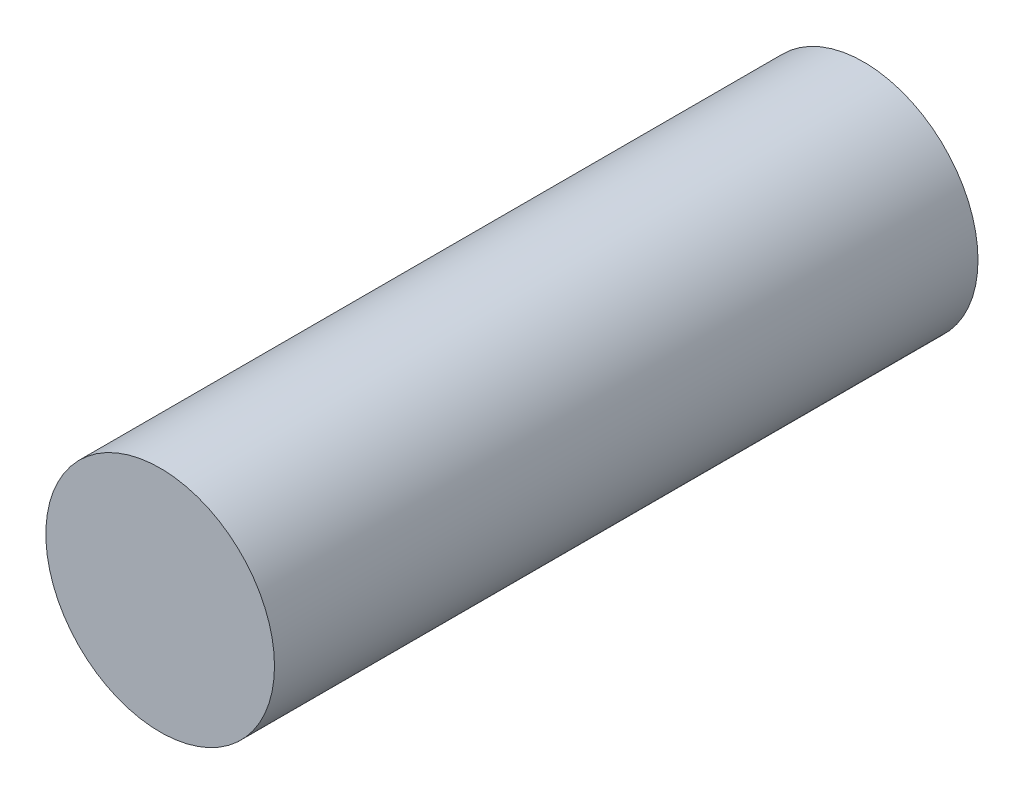
ISO-10303-21;
HEADER;
FILE_DESCRIPTION(('STEP AP214'),'2;1');
FILE_NAME('part.step','',(''),(''),'','','');
FILE_SCHEMA(('AUTOMOTIVE_DESIGN { 1 0 10303 214 1 1 1 1 }'));
ENDSEC;
DATA;
#1=APPLICATION_CONTEXT('core data for automotive mechanical design processes');
#2=APPLICATION_PROTOCOL_DEFINITION('international standard','automotive_design',2000,#1);
#3=PRODUCT_CONTEXT('',#1,'mechanical');
#4=PRODUCT('Part','Part','',(#3));
#5=PRODUCT_RELATED_PRODUCT_CATEGORY('part','',(#4));
#6=PRODUCT_DEFINITION_FORMATION('','',#4);
#7=PRODUCT_DEFINITION_CONTEXT('part definition',#1,'design');
#8=PRODUCT_DEFINITION('design','',#6,#7);
#9=PRODUCT_DEFINITION_SHAPE('','',#8);
#10=(LENGTH_UNIT() NAMED_UNIT(*) SI_UNIT(.MILLI.,.METRE.));
#11=(NAMED_UNIT(*) PLANE_ANGLE_UNIT() SI_UNIT($,.RADIAN.));
#12=(NAMED_UNIT(*) SI_UNIT($,.STERADIAN.) SOLID_ANGLE_UNIT());
#13=UNCERTAINTY_MEASURE_WITH_UNIT(LENGTH_MEASURE(1.E-05),#10,'distance_accuracy_value','');
#14=(GEOMETRIC_REPRESENTATION_CONTEXT(3) GLOBAL_UNCERTAINTY_ASSIGNED_CONTEXT((#13)) GLOBAL_UNIT_ASSIGNED_CONTEXT((#10,
#11,#12)) REPRESENTATION_CONTEXT('',''));
#15=CARTESIAN_POINT('',(0.,0.,0.));
#16=DIRECTION('',(0.,0.,1.));
#17=DIRECTION('',(1.,0.,0.));
#18=AXIS2_PLACEMENT_3D('',#15,#16,#17);
#19=CARTESIAN_POINT('',(0.,0.,30.));
#20=DIRECTION('',(0.,0.,-1.));
#21=DIRECTION('',(-1.,0.,0.));
#22=AXIS2_PLACEMENT_3D('',#19,#20,#21);
#23=CYLINDRICAL_SURFACE('',#22,4.875);
#24=CARTESIAN_POINT('',(0.,0.,30.));
#25=DIRECTION('',(0.,0.,1.));
#26=DIRECTION('',(1.,0.,0.));
#27=AXIS2_PLACEMENT_3D('',#24,#25,#26);
#28=CIRCLE('',#27,4.875);
#29=CARTESIAN_POINT('',(4.875,0.,30.));
#30=VERTEX_POINT('',#29);
#31=EDGE_CURVE('E10',#30,#30,#28,.T.);
#32=ORIENTED_EDGE('',*,*,#31,.F.);
#33=EDGE_LOOP('',(#32));
#34=FACE_BOUND('',#33,.T.);
#35=CARTESIAN_POINT('',(0.,0.,0.));
#36=DIRECTION('',(0.,0.,1.));
#37=DIRECTION('',(1.,0.,0.));
#38=AXIS2_PLACEMENT_3D('',#35,#36,#37);
#39=CIRCLE('',#38,4.875);
#40=CARTESIAN_POINT('',(4.875,0.,0.));
#41=VERTEX_POINT('',#40);
#42=EDGE_CURVE('E38',#41,#41,#39,.T.);
#43=ORIENTED_EDGE('',*,*,#42,.T.);
#44=EDGE_LOOP('',(#43));
#45=FACE_BOUND('',#44,.T.);
#46=ADVANCED_FACE('F35',(#34,#45),#23,.T.);
#47=CARTESIAN_POINT('',(0.,0.,30.));
#48=DIRECTION('',(0.,0.,1.));
#49=DIRECTION('',(1.,0.,0.));
#50=AXIS2_PLACEMENT_3D('',#47,#48,#49);
#51=PLANE('',#50);
#52=ORIENTED_EDGE('',*,*,#31,.T.);
#53=EDGE_LOOP('',(#52));
#54=FACE_BOUND('',#53,.T.);
#55=ADVANCED_FACE('F50',(#54),#51,.T.);
#56=CARTESIAN_POINT('',(0.,0.,0.));
#57=DIRECTION('',(0.,0.,1.));
#58=DIRECTION('',(1.,0.,0.));
#59=AXIS2_PLACEMENT_3D('',#56,#57,#58);
#60=PLANE('',#59);
#61=ORIENTED_EDGE('',*,*,#42,.F.);
#62=EDGE_LOOP('',(#61));
#63=FACE_BOUND('',#62,.T.);
#64=ADVANCED_FACE('F48',(#63),#60,.F.);
#65=CLOSED_SHELL('',(#46,#55,#64));
#66=MANIFOLD_SOLID_BREP('B2',#65);
#67=ADVANCED_BREP_SHAPE_REPRESENTATION('',(#18,#66),#14);
#68=SHAPE_DEFINITION_REPRESENTATION(#9,#67);
ENDSEC;
END-ISO-10303-21;
